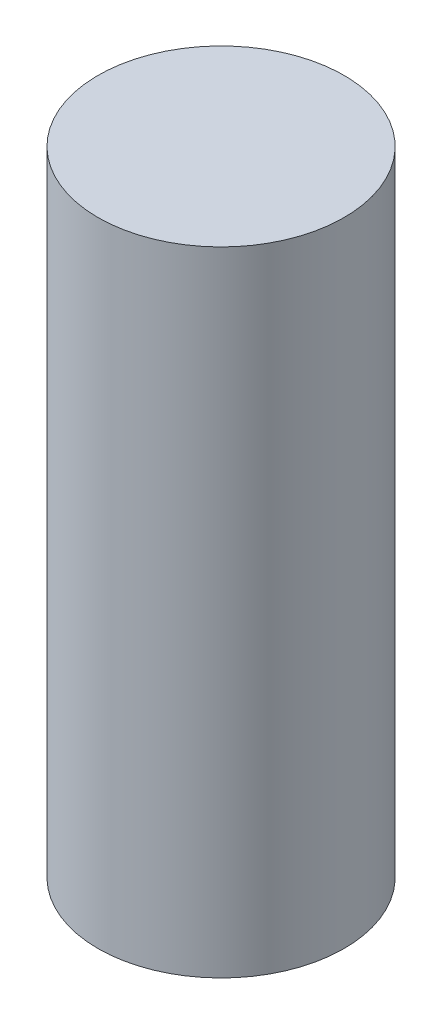
ISO-10303-21;
HEADER;
FILE_DESCRIPTION(('STEP AP214'),'2;1');
FILE_NAME('part.step','',(''),(''),'','','');
FILE_SCHEMA(('AUTOMOTIVE_DESIGN { 1 0 10303 214 1 1 1 1 }'));
ENDSEC;
DATA;
#1=APPLICATION_CONTEXT('core data for automotive mechanical design processes');
#2=APPLICATION_PROTOCOL_DEFINITION('international standard','automotive_design',2000,#1);
#3=PRODUCT_CONTEXT('',#1,'mechanical');
#4=PRODUCT('Part','Part','',(#3));
#5=PRODUCT_RELATED_PRODUCT_CATEGORY('part','',(#4));
#6=PRODUCT_DEFINITION_FORMATION('','',#4);
#7=PRODUCT_DEFINITION_CONTEXT('part definition',#1,'design');
#8=PRODUCT_DEFINITION('design','',#6,#7);
#9=PRODUCT_DEFINITION_SHAPE('','',#8);
#10=(LENGTH_UNIT() NAMED_UNIT(*) SI_UNIT(.MILLI.,.METRE.));
#11=(NAMED_UNIT(*) PLANE_ANGLE_UNIT() SI_UNIT($,.RADIAN.));
#12=(NAMED_UNIT(*) SI_UNIT($,.STERADIAN.) SOLID_ANGLE_UNIT());
#13=UNCERTAINTY_MEASURE_WITH_UNIT(LENGTH_MEASURE(1.E-05),#10,'distance_accuracy_value','');
#14=(GEOMETRIC_REPRESENTATION_CONTEXT(3) GLOBAL_UNCERTAINTY_ASSIGNED_CONTEXT((#13)) GLOBAL_UNIT_ASSIGNED_CONTEXT((#10,
#11,#12)) REPRESENTATION_CONTEXT('',''));
#15=CARTESIAN_POINT('',(0.,0.,0.));
#16=DIRECTION('',(0.,0.,1.));
#17=DIRECTION('',(1.,0.,0.));
#18=AXIS2_PLACEMENT_3D('',#15,#16,#17);
#19=CARTESIAN_POINT('',(0.,9.,0.));
#20=DIRECTION('',(0.,-1.,0.));
#21=DIRECTION('',(0.,0.,-1.));
#22=AXIS2_PLACEMENT_3D('',#19,#20,#21);
#23=CYLINDRICAL_SURFACE('',#22,1.75);
#24=CARTESIAN_POINT('',(0.,9.,0.));
#25=DIRECTION('',(0.,1.,0.));
#26=DIRECTION('',(0.,0.,1.));
#27=AXIS2_PLACEMENT_3D('',#24,#25,#26);
#28=CIRCLE('',#27,1.75);
#29=CARTESIAN_POINT('',(0.,9.,1.75));
#30=VERTEX_POINT('',#29);
#31=EDGE_CURVE('E10',#30,#30,#28,.T.);
#32=ORIENTED_EDGE('',*,*,#31,.F.);
#33=EDGE_LOOP('',(#32));
#34=FACE_BOUND('',#33,.T.);
#35=CARTESIAN_POINT('',(0.,0.,0.));
#36=DIRECTION('',(0.,1.,0.));
#37=DIRECTION('',(0.,0.,1.));
#38=AXIS2_PLACEMENT_3D('',#35,#36,#37);
#39=CIRCLE('',#38,1.75);
#40=CARTESIAN_POINT('',(0.,0.,1.75));
#41=VERTEX_POINT('',#40);
#42=EDGE_CURVE('E34',#41,#41,#39,.T.);
#43=ORIENTED_EDGE('',*,*,#42,.T.);
#44=EDGE_LOOP('',(#43));
#45=FACE_BOUND('',#44,.T.);
#46=ADVANCED_FACE('F31',(#34,#45),#23,.T.);
#47=CARTESIAN_POINT('',(0.,9.,0.));
#48=DIRECTION('',(0.,1.,0.));
#49=DIRECTION('',(0.,0.,1.));
#50=AXIS2_PLACEMENT_3D('',#47,#48,#49);
#51=PLANE('',#50);
#52=ORIENTED_EDGE('',*,*,#31,.T.);
#53=EDGE_LOOP('',(#52));
#54=FACE_BOUND('',#53,.T.);
#55=ADVANCED_FACE('F46',(#54),#51,.T.);
#56=CARTESIAN_POINT('',(0.,0.,0.));
#57=DIRECTION('',(0.,1.,0.));
#58=DIRECTION('',(0.,0.,1.));
#59=AXIS2_PLACEMENT_3D('',#56,#57,#58);
#60=PLANE('',#59);
#61=ORIENTED_EDGE('',*,*,#42,.F.);
#62=EDGE_LOOP('',(#61));
#63=FACE_BOUND('',#62,.T.);
#64=ADVANCED_FACE('F44',(#63),#60,.F.);
#65=CLOSED_SHELL('',(#46,#55,#64));
#66=MANIFOLD_SOLID_BREP('B2',#65);
#67=ADVANCED_BREP_SHAPE_REPRESENTATION('',(#18,#66),#14);
#68=SHAPE_DEFINITION_REPRESENTATION(#9,#67);
ENDSEC;
END-ISO-10303-21;
